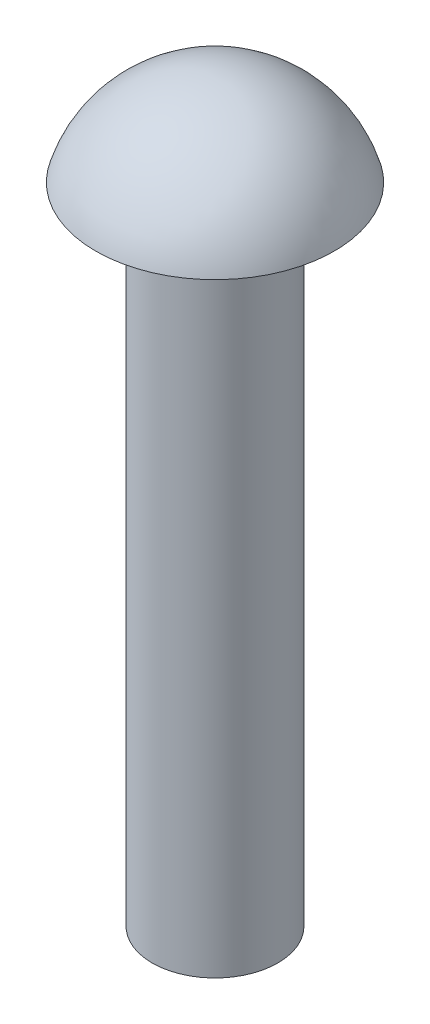
ISO-10303-21;
HEADER;
FILE_DESCRIPTION(('STEP AP214'),'2;1');
FILE_NAME('part.step','',(''),(''),'','','');
FILE_SCHEMA(('AUTOMOTIVE_DESIGN { 1 0 10303 214 1 1 1 1 }'));
ENDSEC;
DATA;
#1=APPLICATION_CONTEXT('core data for automotive mechanical design processes');
#2=APPLICATION_PROTOCOL_DEFINITION('international standard','automotive_design',2000,#1);
#3=PRODUCT_CONTEXT('',#1,'mechanical');
#4=PRODUCT('Part','Part','',(#3));
#5=PRODUCT_RELATED_PRODUCT_CATEGORY('part','',(#4));
#6=PRODUCT_DEFINITION_FORMATION('','',#4);
#7=PRODUCT_DEFINITION_CONTEXT('part definition',#1,'design');
#8=PRODUCT_DEFINITION('design','',#6,#7);
#9=PRODUCT_DEFINITION_SHAPE('','',#8);
#10=(LENGTH_UNIT() NAMED_UNIT(*) SI_UNIT(.MILLI.,.METRE.));
#11=(NAMED_UNIT(*) PLANE_ANGLE_UNIT() SI_UNIT($,.RADIAN.));
#12=(NAMED_UNIT(*) SI_UNIT($,.STERADIAN.) SOLID_ANGLE_UNIT());
#13=UNCERTAINTY_MEASURE_WITH_UNIT(LENGTH_MEASURE(1.E-05),#10,'distance_accuracy_value','');
#14=(GEOMETRIC_REPRESENTATION_CONTEXT(3) GLOBAL_UNCERTAINTY_ASSIGNED_CONTEXT((#13)) GLOBAL_UNIT_ASSIGNED_CONTEXT((#10,
#11,#12)) REPRESENTATION_CONTEXT('',''));
#15=CARTESIAN_POINT('',(0.,0.,0.));
#16=DIRECTION('',(0.,0.,1.));
#17=DIRECTION('',(1.,0.,0.));
#18=AXIS2_PLACEMENT_3D('',#15,#16,#17);
#19=CARTESIAN_POINT('',(0.,-1.92232142857143,0.));
#20=DIRECTION('',(0.,1.,0.));
#21=DIRECTION('',(0.,0.,-1.));
#22=AXIS2_PLACEMENT_3D('',#19,#20,#21);
#23=SPHERICAL_SURFACE('',#22,1.92232142857143);
#24=CARTESIAN_POINT('',(0.,-1.4,0.));
#25=DIRECTION('',(0.,1.,0.));
#26=DIRECTION('',(0.,0.,1.));
#27=AXIS2_PLACEMENT_3D('',#24,#25,#26);
#28=CIRCLE('',#27,1.85);
#29=CARTESIAN_POINT('',(0.,-1.4,1.85));
#30=VERTEX_POINT('',#29);
#31=EDGE_CURVE('E47',#30,#30,#28,.T.);
#32=ORIENTED_EDGE('',*,*,#31,.T.);
#33=EDGE_LOOP('',(#32));
#34=FACE_BOUND('',#33,.T.);
#35=ADVANCED_FACE('F37',(#34),#23,.T.);
#36=CARTESIAN_POINT('',(0.,-11.4,0.));
#37=DIRECTION('',(0.,1.,0.));
#38=DIRECTION('',(0.,0.,1.));
#39=AXIS2_PLACEMENT_3D('',#36,#37,#38);
#40=PLANE('',#39);
#41=CARTESIAN_POINT('',(0.,-11.4,0.));
#42=DIRECTION('',(0.,1.,0.));
#43=DIRECTION('',(0.,0.,1.));
#44=AXIS2_PLACEMENT_3D('',#41,#42,#43);
#45=CIRCLE('',#44,0.975);
#46=CARTESIAN_POINT('',(0.,-11.4,0.974999999999999));
#47=VERTEX_POINT('',#46);
#48=EDGE_CURVE('E10',#47,#47,#45,.T.);
#49=ORIENTED_EDGE('',*,*,#48,.F.);
#50=EDGE_LOOP('',(#49));
#51=FACE_BOUND('',#50,.T.);
#52=ADVANCED_FACE('F62',(#51),#40,.F.);
#53=CARTESIAN_POINT('',(0.,0.,0.));
#54=DIRECTION('',(0.,1.,0.));
#55=DIRECTION('',(0.,0.,1.));
#56=AXIS2_PLACEMENT_3D('',#53,#54,#55);
#57=CYLINDRICAL_SURFACE('',#56,0.975000000000001);
#58=CARTESIAN_POINT('',(0.,-1.4,0.));
#59=DIRECTION('',(0.,1.,0.));
#60=DIRECTION('',(0.,0.,1.));
#61=AXIS2_PLACEMENT_3D('',#58,#59,#60);
#62=CIRCLE('',#61,0.975000000000001);
#63=CARTESIAN_POINT('',(0.,-1.4,0.975000000000001));
#64=VERTEX_POINT('',#63);
#65=EDGE_CURVE('E43',#64,#64,#62,.T.);
#66=ORIENTED_EDGE('',*,*,#65,.F.);
#67=EDGE_LOOP('',(#66));
#68=FACE_BOUND('',#67,.T.);
#69=ORIENTED_EDGE('',*,*,#48,.T.);
#70=EDGE_LOOP('',(#69));
#71=FACE_BOUND('',#70,.T.);
#72=ADVANCED_FACE('F57',(#68,#71),#57,.T.);
#73=CARTESIAN_POINT('',(0.,-1.4,-0.975000000000001));
#74=DIRECTION('',(0.,1.,0.));
#75=DIRECTION('',(0.,0.,1.));
#76=AXIS2_PLACEMENT_3D('',#73,#74,#75);
#77=PLANE('',#76);
#78=ORIENTED_EDGE('',*,*,#31,.F.);
#79=EDGE_LOOP('',(#78));
#80=FACE_BOUND('',#79,.T.);
#81=ORIENTED_EDGE('',*,*,#65,.T.);
#82=EDGE_LOOP('',(#81));
#83=FACE_BOUND('',#82,.T.);
#84=ADVANCED_FACE('F55',(#80,#83),#77,.F.);
#85=CLOSED_SHELL('',(#35,#52,#72,#84));
#86=MANIFOLD_SOLID_BREP('B2',#85);
#87=ADVANCED_BREP_SHAPE_REPRESENTATION('',(#18,#86),#14);
#88=SHAPE_DEFINITION_REPRESENTATION(#9,#87);
ENDSEC;
END-ISO-10303-21;
